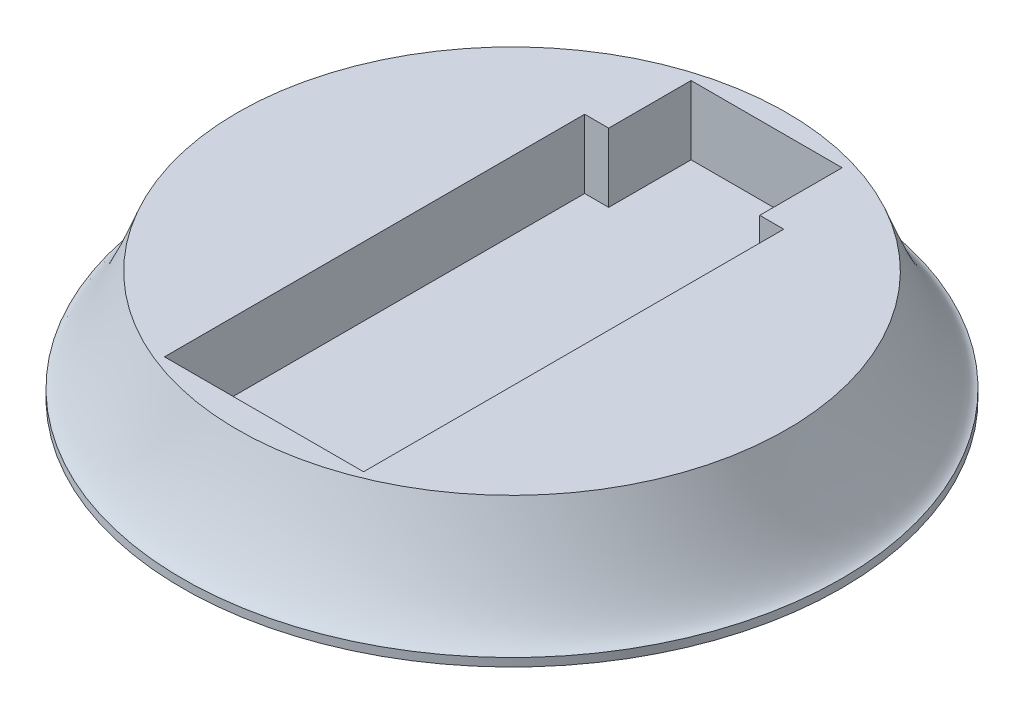
ISO-10303-21;
HEADER;
FILE_DESCRIPTION(('STEP AP214'),'2;1');
FILE_NAME('part.step','',(''),(''),'','','');
FILE_SCHEMA(('AUTOMOTIVE_DESIGN { 1 0 10303 214 1 1 1 1 }'));
ENDSEC;
DATA;
#1=APPLICATION_CONTEXT('core data for automotive mechanical design processes');
#2=APPLICATION_PROTOCOL_DEFINITION('international standard','automotive_design',2000,#1);
#3=PRODUCT_CONTEXT('',#1,'mechanical');
#4=PRODUCT('Part','Part','',(#3));
#5=PRODUCT_RELATED_PRODUCT_CATEGORY('part','',(#4));
#6=PRODUCT_DEFINITION_FORMATION('','',#4);
#7=PRODUCT_DEFINITION_CONTEXT('part definition',#1,'design');
#8=PRODUCT_DEFINITION('design','',#6,#7);
#9=PRODUCT_DEFINITION_SHAPE('','',#8);
#10=(LENGTH_UNIT() NAMED_UNIT(*) SI_UNIT(.MILLI.,.METRE.));
#11=(NAMED_UNIT(*) PLANE_ANGLE_UNIT() SI_UNIT($,.RADIAN.));
#12=(NAMED_UNIT(*) SI_UNIT($,.STERADIAN.) SOLID_ANGLE_UNIT());
#13=UNCERTAINTY_MEASURE_WITH_UNIT(LENGTH_MEASURE(1.E-05),#10,'distance_accuracy_value','');
#14=(GEOMETRIC_REPRESENTATION_CONTEXT(3) GLOBAL_UNCERTAINTY_ASSIGNED_CONTEXT((#13)) GLOBAL_UNIT_ASSIGNED_CONTEXT((#10,
#11,#12)) REPRESENTATION_CONTEXT('',''));
#15=CARTESIAN_POINT('',(0.,0.,0.));
#16=DIRECTION('',(0.,0.,1.));
#17=DIRECTION('',(1.,0.,0.));
#18=AXIS2_PLACEMENT_3D('',#15,#16,#17);
#19=CARTESIAN_POINT('',(100.,40.,0.));
#20=DIRECTION('',(0.,-1.,0.));
#21=DIRECTION('',(1.,0.,0.));
#22=AXIS2_PLACEMENT_3D('',#19,#20,#21);
#23=PLANE('',#22);
#24=DIRECTION('',(-1.,0.,0.));
#25=VECTOR('',#24,1.);
#26=CARTESIAN_POINT('',(36.25,40.,-62.7095108745931));
#27=LINE('',#26,#25);
#28=CARTESIAN_POINT('',(36.25,40.,-62.7095108745931));
#29=VERTEX_POINT('',#28);
#30=CARTESIAN_POINT('',(27.5,40.,-62.7095108745933));
#31=VERTEX_POINT('',#30);
#32=EDGE_CURVE('E146',#29,#31,#27,.T.);
#33=ORIENTED_EDGE('',*,*,#32,.F.);
#34=DIRECTION('',(0.,0.,-1.));
#35=VECTOR('',#34,1.);
#36=CARTESIAN_POINT('',(36.25,40.,90.2904891254068));
#37=LINE('',#36,#35);
#38=CARTESIAN_POINT('',(36.25,40.,90.2904891254068));
#39=VERTEX_POINT('',#38);
#40=EDGE_CURVE('E54',#39,#29,#37,.T.);
#41=ORIENTED_EDGE('',*,*,#40,.F.);
#42=DIRECTION('',(1.,0.,0.));
#43=VECTOR('',#42,1.);
#44=CARTESIAN_POINT('',(36.25,40.,90.2904891254068));
#45=LINE('',#44,#43);
#46=CARTESIAN_POINT('',(-36.25,40.,90.2904891254068));
#47=VERTEX_POINT('',#46);
#48=EDGE_CURVE('E167',#47,#39,#45,.T.);
#49=ORIENTED_EDGE('',*,*,#48,.F.);
#50=DIRECTION('',(0.,0.,1.));
#51=VECTOR('',#50,1.);
#52=CARTESIAN_POINT('',(-36.25,40.,90.2904891254068));
#53=LINE('',#52,#51);
#54=CARTESIAN_POINT('',(-36.25,40.,-62.7095108745931));
#55=VERTEX_POINT('',#54);
#56=EDGE_CURVE('E164',#55,#47,#53,.T.);
#57=ORIENTED_EDGE('',*,*,#56,.F.);
#58=DIRECTION('',(-1.,0.,0.));
#59=VECTOR('',#58,1.);
#60=CARTESIAN_POINT('',(-27.5,40.,-62.7095108745933));
#61=LINE('',#60,#59);
#62=CARTESIAN_POINT('',(-27.5,40.,-62.7095108745933));
#63=VERTEX_POINT('',#62);
#64=EDGE_CURVE('E114',#63,#55,#61,.T.);
#65=ORIENTED_EDGE('',*,*,#64,.F.);
#66=DIRECTION('',(0.,0.,1.));
#67=VECTOR('',#66,1.);
#68=CARTESIAN_POINT('',(-27.5,40.,-62.7095108745933));
#69=LINE('',#68,#67);
#70=CARTESIAN_POINT('',(-27.5,40.,-92.7095108745932));
#71=VERTEX_POINT('',#70);
#72=EDGE_CURVE('E158',#71,#63,#69,.T.);
#73=ORIENTED_EDGE('',*,*,#72,.F.);
#74=DIRECTION('',(-1.,0.,0.));
#75=VECTOR('',#74,1.);
#76=CARTESIAN_POINT('',(27.5,40.,-92.7095108745932));
#77=LINE('',#76,#75);
#78=CARTESIAN_POINT('',(27.5,40.,-92.7095108745932));
#79=VERTEX_POINT('',#78);
#80=EDGE_CURVE('E154',#79,#71,#77,.T.);
#81=ORIENTED_EDGE('',*,*,#80,.F.);
#82=DIRECTION('',(0.,0.,-1.));
#83=VECTOR('',#82,1.);
#84=CARTESIAN_POINT('',(27.5,40.,-62.7095108745933));
#85=LINE('',#84,#83);
#86=EDGE_CURVE('E150',#31,#79,#85,.T.);
#87=ORIENTED_EDGE('',*,*,#86,.F.);
#88=EDGE_LOOP('',(#33,#41,#49,#57,#65,#73,#81,#87));
#89=FACE_BOUND('',#88,.T.);
#90=CARTESIAN_POINT('',(0.,40.,0.));
#91=DIRECTION('',(0.,1.,0.));
#92=DIRECTION('',(-1.,0.,0.));
#93=AXIS2_PLACEMENT_3D('',#90,#91,#92);
#94=CIRCLE('',#93,100.);
#95=CARTESIAN_POINT('',(-100.,40.,0.));
#96=VERTEX_POINT('',#95);
#97=EDGE_CURVE('E11',#96,#96,#94,.T.);
#98=ORIENTED_EDGE('',*,*,#97,.T.);
#99=EDGE_LOOP('',(#98));
#100=FACE_BOUND('',#99,.T.);
#101=ADVANCED_FACE('F39',(#89,#100),#23,.F.);
#102=CARTESIAN_POINT('',(120.,3.,0.));
#103=CARTESIAN_POINT('',(113.46477361613,4.30015584285204,0.));
#104=CARTESIAN_POINT('',(100.,40.,0.));
#105=B_SPLINE_CURVE_WITH_KNOTS('',2,(#102,#103,#104),.UNSPECIFIED.,.F.,.F.,(3,3),(0.,
0.922507556106031),.UNSPECIFIED.);
#106=CARTESIAN_POINT('',(0.,40.,0.));
#107=DIRECTION('',(0.,1.,0.));
#108=AXIS1_PLACEMENT('',#106,#107);
#109=SURFACE_OF_REVOLUTION('',#105,#108);
#110=ORIENTED_EDGE('',*,*,#97,.F.);
#111=EDGE_LOOP('',(#110));
#112=FACE_BOUND('',#111,.T.);
#113=CARTESIAN_POINT('',(0.,3.00000000000001,0.));
#114=DIRECTION('',(0.,1.,0.));
#115=DIRECTION('',(-1.,0.,0.));
#116=AXIS2_PLACEMENT_3D('',#113,#114,#115);
#117=CIRCLE('',#116,120.);
#118=CARTESIAN_POINT('',(-120.,3.00000000000002,0.));
#119=VERTEX_POINT('',#118);
#120=EDGE_CURVE('E47',#119,#119,#117,.T.);
#121=ORIENTED_EDGE('',*,*,#120,.T.);
#122=EDGE_LOOP('',(#121));
#123=FACE_BOUND('',#122,.T.);
#124=ADVANCED_FACE('F196',(#112,#123),#109,.T.);
#125=CARTESIAN_POINT('',(0.,40.,0.));
#126=DIRECTION('',(0.,1.,0.));
#127=DIRECTION('',(-1.,0.,0.));
#128=AXIS2_PLACEMENT_3D('',#125,#126,#127);
#129=CYLINDRICAL_SURFACE('',#128,120.);
#130=ORIENTED_EDGE('',*,*,#120,.F.);
#131=EDGE_LOOP('',(#130));
#132=FACE_BOUND('',#131,.T.);
#133=CARTESIAN_POINT('',(0.,0.,0.));
#134=DIRECTION('',(0.,1.,0.));
#135=DIRECTION('',(-1.,0.,0.));
#136=AXIS2_PLACEMENT_3D('',#133,#134,#135);
#137=CIRCLE('',#136,120.);
#138=CARTESIAN_POINT('',(-120.,0.,0.));
#139=VERTEX_POINT('',#138);
#140=EDGE_CURVE('E173',#139,#139,#137,.T.);
#141=ORIENTED_EDGE('',*,*,#140,.T.);
#142=EDGE_LOOP('',(#141));
#143=FACE_BOUND('',#142,.T.);
#144=ADVANCED_FACE('F199',(#132,#143),#129,.T.);
#145=CARTESIAN_POINT('',(0.,0.,0.));
#146=DIRECTION('',(0.,1.,0.));
#147=DIRECTION('',(-1.,0.,0.));
#148=AXIS2_PLACEMENT_3D('',#145,#146,#147);
#149=PLANE('',#148);
#150=ORIENTED_EDGE('',*,*,#140,.F.);
#151=EDGE_LOOP('',(#150));
#152=FACE_BOUND('',#151,.T.);
#153=ADVANCED_FACE('F203',(#152),#149,.F.);
#154=CARTESIAN_POINT('',(36.25,15.,90.2904891254068));
#155=DIRECTION('',(1.,0.,0.));
#156=DIRECTION('',(0.,0.,-1.));
#157=AXIS2_PLACEMENT_3D('',#154,#155,#156);
#158=PLANE('',#157);
#159=ORIENTED_EDGE('',*,*,#40,.T.);
#160=DIRECTION('',(0.,1.,0.));
#161=VECTOR('',#160,1.);
#162=CARTESIAN_POINT('',(36.25,15.,-62.7095108745931));
#163=LINE('',#162,#161);
#164=CARTESIAN_POINT('',(36.25,15.,-62.7095108745931));
#165=VERTEX_POINT('',#164);
#166=EDGE_CURVE('E90',#165,#29,#163,.T.);
#167=ORIENTED_EDGE('',*,*,#166,.F.);
#168=DIRECTION('',(0.,0.,-1.));
#169=VECTOR('',#168,1.);
#170=CARTESIAN_POINT('',(36.25,15.,90.2904891254068));
#171=LINE('',#170,#169);
#172=CARTESIAN_POINT('',(36.25,15.,90.2904891254068));
#173=VERTEX_POINT('',#172);
#174=EDGE_CURVE('E170',#173,#165,#171,.T.);
#175=ORIENTED_EDGE('',*,*,#174,.F.);
#176=DIRECTION('',(0.,1.,0.));
#177=VECTOR('',#176,1.);
#178=CARTESIAN_POINT('',(36.25,15.,90.2904891254068));
#179=LINE('',#178,#177);
#180=EDGE_CURVE('E62',#173,#39,#179,.T.);
#181=ORIENTED_EDGE('',*,*,#180,.T.);
#182=EDGE_LOOP('',(#159,#167,#175,#181));
#183=FACE_BOUND('',#182,.T.);
#184=ADVANCED_FACE('F207',(#183),#158,.F.);
#185=CARTESIAN_POINT('',(36.25,15.,90.2904891254068));
#186=DIRECTION('',(0.,0.,1.));
#187=DIRECTION('',(1.,0.,0.));
#188=AXIS2_PLACEMENT_3D('',#185,#186,#187);
#189=PLANE('',#188);
#190=ORIENTED_EDGE('',*,*,#48,.T.);
#191=ORIENTED_EDGE('',*,*,#180,.F.);
#192=DIRECTION('',(1.,0.,0.));
#193=VECTOR('',#192,1.);
#194=CARTESIAN_POINT('',(36.25,15.,90.2904891254068));
#195=LINE('',#194,#193);
#196=CARTESIAN_POINT('',(-36.25,15.,90.2904891254068));
#197=VERTEX_POINT('',#196);
#198=EDGE_CURVE('E128',#197,#173,#195,.T.);
#199=ORIENTED_EDGE('',*,*,#198,.F.);
#200=DIRECTION('',(0.,1.,0.));
#201=VECTOR('',#200,1.);
#202=CARTESIAN_POINT('',(-36.25,15.,90.2904891254068));
#203=LINE('',#202,#201);
#204=EDGE_CURVE('E119',#197,#47,#203,.T.);
#205=ORIENTED_EDGE('',*,*,#204,.T.);
#206=EDGE_LOOP('',(#190,#191,#199,#205));
#207=FACE_BOUND('',#206,.T.);
#208=ADVANCED_FACE('F211',(#207),#189,.F.);
#209=CARTESIAN_POINT('',(-36.25,15.,90.2904891254068));
#210=DIRECTION('',(-1.,0.,0.));
#211=DIRECTION('',(0.,-1.,0.));
#212=AXIS2_PLACEMENT_3D('',#209,#210,#211);
#213=PLANE('',#212);
#214=ORIENTED_EDGE('',*,*,#56,.T.);
#215=ORIENTED_EDGE('',*,*,#204,.F.);
#216=DIRECTION('',(0.,0.,1.));
#217=VECTOR('',#216,1.);
#218=CARTESIAN_POINT('',(-36.25,15.,90.2904891254068));
#219=LINE('',#218,#217);
#220=CARTESIAN_POINT('',(-36.25,15.,-62.7095108745931));
#221=VERTEX_POINT('',#220);
#222=EDGE_CURVE('E123',#221,#197,#219,.T.);
#223=ORIENTED_EDGE('',*,*,#222,.F.);
#224=DIRECTION('',(0.,1.,0.));
#225=VECTOR('',#224,1.);
#226=CARTESIAN_POINT('',(-36.25,15.,-62.7095108745931));
#227=LINE('',#226,#225);
#228=EDGE_CURVE('E107',#221,#55,#227,.T.);
#229=ORIENTED_EDGE('',*,*,#228,.T.);
#230=EDGE_LOOP('',(#214,#215,#223,#229));
#231=FACE_BOUND('',#230,.T.);
#232=ADVANCED_FACE('F124',(#231),#213,.F.);
#233=CARTESIAN_POINT('',(-27.5,15.,-62.7095108745933));
#234=DIRECTION('',(0.,0.,-1.));
#235=DIRECTION('',(-1.,0.,0.));
#236=AXIS2_PLACEMENT_3D('',#233,#234,#235);
#237=PLANE('',#236);
#238=ORIENTED_EDGE('',*,*,#64,.T.);
#239=ORIENTED_EDGE('',*,*,#228,.F.);
#240=DIRECTION('',(-1.,0.,0.));
#241=VECTOR('',#240,1.);
#242=CARTESIAN_POINT('',(-27.5,15.,-62.7095108745933));
#243=LINE('',#242,#241);
#244=CARTESIAN_POINT('',(-27.5,15.,-62.7095108745933));
#245=VERTEX_POINT('',#244);
#246=EDGE_CURVE('E111',#245,#221,#243,.T.);
#247=ORIENTED_EDGE('',*,*,#246,.F.);
#248=DIRECTION('',(0.,1.,0.));
#249=VECTOR('',#248,1.);
#250=CARTESIAN_POINT('',(-27.5,15.,-62.7095108745933));
#251=LINE('',#250,#249);
#252=EDGE_CURVE('E120',#245,#63,#251,.T.);
#253=ORIENTED_EDGE('',*,*,#252,.T.);
#254=EDGE_LOOP('',(#238,#239,#247,#253));
#255=FACE_BOUND('',#254,.T.);
#256=ADVANCED_FACE('F109',(#255),#237,.F.);
#257=CARTESIAN_POINT('',(-27.5,15.,-62.7095108745933));
#258=DIRECTION('',(-1.,0.,0.));
#259=DIRECTION('',(0.,0.,1.));
#260=AXIS2_PLACEMENT_3D('',#257,#258,#259);
#261=PLANE('',#260);
#262=ORIENTED_EDGE('',*,*,#72,.T.);
#263=ORIENTED_EDGE('',*,*,#252,.F.);
#264=DIRECTION('',(0.,0.,1.));
#265=VECTOR('',#264,1.);
#266=CARTESIAN_POINT('',(-27.5,15.,-62.7095108745933));
#267=LINE('',#266,#265);
#268=CARTESIAN_POINT('',(-27.5,15.,-92.7095108745932));
#269=VERTEX_POINT('',#268);
#270=EDGE_CURVE('E134',#269,#245,#267,.T.);
#271=ORIENTED_EDGE('',*,*,#270,.F.);
#272=DIRECTION('',(0.,1.,0.));
#273=VECTOR('',#272,1.);
#274=CARTESIAN_POINT('',(-27.5,15.,-92.7095108745932));
#275=LINE('',#274,#273);
#276=EDGE_CURVE('E178',#269,#71,#275,.T.);
#277=ORIENTED_EDGE('',*,*,#276,.T.);
#278=EDGE_LOOP('',(#262,#263,#271,#277));
#279=FACE_BOUND('',#278,.T.);
#280=ADVANCED_FACE('F223',(#279),#261,.F.);
#281=CARTESIAN_POINT('',(27.5,15.,-92.7095108745932));
#282=DIRECTION('',(0.,0.,-1.));
#283=DIRECTION('',(-1.,0.,0.));
#284=AXIS2_PLACEMENT_3D('',#281,#282,#283);
#285=PLANE('',#284);
#286=ORIENTED_EDGE('',*,*,#80,.T.);
#287=ORIENTED_EDGE('',*,*,#276,.F.);
#288=DIRECTION('',(-1.,0.,0.));
#289=VECTOR('',#288,1.);
#290=CARTESIAN_POINT('',(27.5,15.,-92.7095108745932));
#291=LINE('',#290,#289);
#292=CARTESIAN_POINT('',(27.5,15.,-92.7095108745932));
#293=VERTEX_POINT('',#292);
#294=EDGE_CURVE('E138',#293,#269,#291,.T.);
#295=ORIENTED_EDGE('',*,*,#294,.F.);
#296=DIRECTION('',(0.,1.,0.));
#297=VECTOR('',#296,1.);
#298=CARTESIAN_POINT('',(27.5,15.,-92.7095108745932));
#299=LINE('',#298,#297);
#300=EDGE_CURVE('E181',#293,#79,#299,.T.);
#301=ORIENTED_EDGE('',*,*,#300,.T.);
#302=EDGE_LOOP('',(#286,#287,#295,#301));
#303=FACE_BOUND('',#302,.T.);
#304=ADVANCED_FACE('F219',(#303),#285,.F.);
#305=CARTESIAN_POINT('',(27.5,15.,-62.7095108745933));
#306=DIRECTION('',(1.,0.,0.));
#307=DIRECTION('',(0.,1.,0.));
#308=AXIS2_PLACEMENT_3D('',#305,#306,#307);
#309=PLANE('',#308);
#310=ORIENTED_EDGE('',*,*,#86,.T.);
#311=ORIENTED_EDGE('',*,*,#300,.F.);
#312=DIRECTION('',(0.,0.,-1.));
#313=VECTOR('',#312,1.);
#314=CARTESIAN_POINT('',(27.5,15.,-62.7095108745933));
#315=LINE('',#314,#313);
#316=CARTESIAN_POINT('',(27.5,15.,-62.7095108745933));
#317=VERTEX_POINT('',#316);
#318=EDGE_CURVE('E260',#317,#293,#315,.T.);
#319=ORIENTED_EDGE('',*,*,#318,.F.);
#320=DIRECTION('',(0.,1.,0.));
#321=VECTOR('',#320,1.);
#322=CARTESIAN_POINT('',(27.5,15.,-62.7095108745933));
#323=LINE('',#322,#321);
#324=EDGE_CURVE('E184',#317,#31,#323,.T.);
#325=ORIENTED_EDGE('',*,*,#324,.T.);
#326=EDGE_LOOP('',(#310,#311,#319,#325));
#327=FACE_BOUND('',#326,.T.);
#328=ADVANCED_FACE('F215',(#327),#309,.F.);
#329=CARTESIAN_POINT('',(36.25,15.,-62.7095108745931));
#330=DIRECTION('',(0.,0.,-1.));
#331=DIRECTION('',(-1.,0.,0.));
#332=AXIS2_PLACEMENT_3D('',#329,#330,#331);
#333=PLANE('',#332);
#334=ORIENTED_EDGE('',*,*,#32,.T.);
#335=ORIENTED_EDGE('',*,*,#324,.F.);
#336=DIRECTION('',(-1.,0.,0.));
#337=VECTOR('',#336,1.);
#338=CARTESIAN_POINT('',(36.25,15.,-62.7095108745931));
#339=LINE('',#338,#337);
#340=EDGE_CURVE('E257',#165,#317,#339,.T.);
#341=ORIENTED_EDGE('',*,*,#340,.F.);
#342=ORIENTED_EDGE('',*,*,#166,.T.);
#343=EDGE_LOOP('',(#334,#335,#341,#342));
#344=FACE_BOUND('',#343,.T.);
#345=ADVANCED_FACE('F212',(#344),#333,.F.);
#346=CARTESIAN_POINT('',(0.,15.,0.));
#347=DIRECTION('',(0.,1.,0.));
#348=DIRECTION('',(0.,0.,1.));
#349=AXIS2_PLACEMENT_3D('',#346,#347,#348);
#350=PLANE('',#349);
#351=ORIENTED_EDGE('',*,*,#174,.T.);
#352=ORIENTED_EDGE('',*,*,#340,.T.);
#353=ORIENTED_EDGE('',*,*,#318,.T.);
#354=ORIENTED_EDGE('',*,*,#294,.T.);
#355=ORIENTED_EDGE('',*,*,#270,.T.);
#356=ORIENTED_EDGE('',*,*,#246,.T.);
#357=ORIENTED_EDGE('',*,*,#222,.T.);
#358=ORIENTED_EDGE('',*,*,#198,.T.);
#359=EDGE_LOOP('',(#351,#352,#353,#354,#355,#356,#357,#358));
#360=FACE_BOUND('',#359,.T.);
#361=ADVANCED_FACE('F131',(#360),#350,.T.);
#362=CLOSED_SHELL('',(#101,#124,#144,#153,#184,#208,#232,#256,#280,#304,#328,#345,#361));
#363=MANIFOLD_SOLID_BREP('B2',#362);
#364=ADVANCED_BREP_SHAPE_REPRESENTATION('',(#18,#363),#14);
#365=SHAPE_DEFINITION_REPRESENTATION(#9,#364);
ENDSEC;
END-ISO-10303-21;
